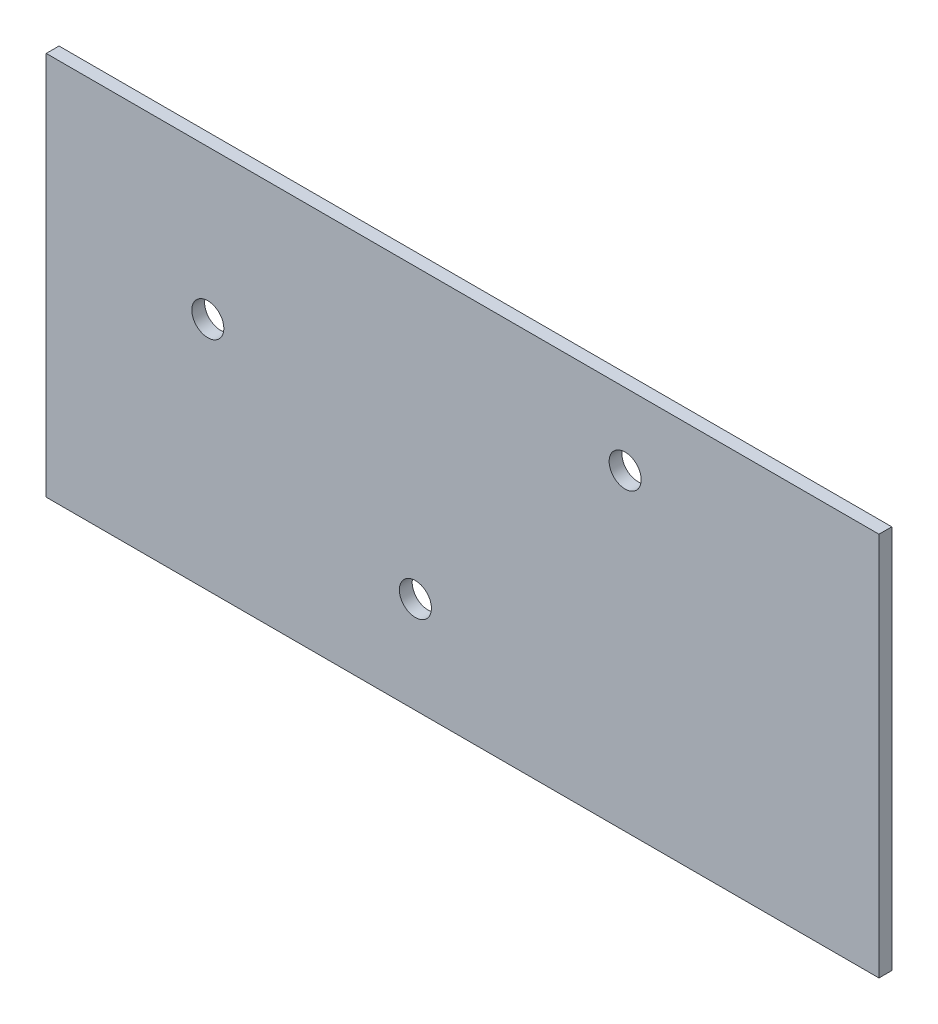
ISO-10303-21;
HEADER;
FILE_DESCRIPTION(('STEP AP214'),'2;1');
FILE_NAME('part.step','',(''),(''),'','','');
FILE_SCHEMA(('AUTOMOTIVE_DESIGN { 1 0 10303 214 1 1 1 1 }'));
ENDSEC;
DATA;
#1=APPLICATION_CONTEXT('core data for automotive mechanical design processes');
#2=APPLICATION_PROTOCOL_DEFINITION('international standard','automotive_design',2000,#1);
#3=PRODUCT_CONTEXT('',#1,'mechanical');
#4=PRODUCT('Part','Part','',(#3));
#5=PRODUCT_RELATED_PRODUCT_CATEGORY('part','',(#4));
#6=PRODUCT_DEFINITION_FORMATION('','',#4);
#7=PRODUCT_DEFINITION_CONTEXT('part definition',#1,'design');
#8=PRODUCT_DEFINITION('design','',#6,#7);
#9=PRODUCT_DEFINITION_SHAPE('','',#8);
#10=(LENGTH_UNIT() NAMED_UNIT(*) SI_UNIT(.MILLI.,.METRE.));
#11=(NAMED_UNIT(*) PLANE_ANGLE_UNIT() SI_UNIT($,.RADIAN.));
#12=(NAMED_UNIT(*) SI_UNIT($,.STERADIAN.) SOLID_ANGLE_UNIT());
#13=UNCERTAINTY_MEASURE_WITH_UNIT(LENGTH_MEASURE(1.E-05),#10,'distance_accuracy_value','');
#14=(GEOMETRIC_REPRESENTATION_CONTEXT(3) GLOBAL_UNCERTAINTY_ASSIGNED_CONTEXT((#13)) GLOBAL_UNIT_ASSIGNED_CONTEXT((#10,
#11,#12)) REPRESENTATION_CONTEXT('',''));
#15=CARTESIAN_POINT('',(0.,0.,0.));
#16=DIRECTION('',(0.,0.,1.));
#17=DIRECTION('',(1.,0.,0.));
#18=AXIS2_PLACEMENT_3D('',#15,#16,#17);
#19=CARTESIAN_POINT('',(-82.55,-38.1,2.54));
#20=DIRECTION('',(1.,0.,0.));
#21=DIRECTION('',(0.,0.,-1.));
#22=AXIS2_PLACEMENT_3D('',#19,#20,#21);
#23=PLANE('',#22);
#24=DIRECTION('',(0.,-1.,0.));
#25=VECTOR('',#24,1.);
#26=CARTESIAN_POINT('',(-82.55,-38.1,0.));
#27=LINE('',#26,#25);
#28=CARTESIAN_POINT('',(-82.55,38.1,0.));
#29=VERTEX_POINT('',#28);
#30=CARTESIAN_POINT('',(-82.55,-38.1,0.));
#31=VERTEX_POINT('',#30);
#32=EDGE_CURVE('E107',#29,#31,#27,.T.);
#33=ORIENTED_EDGE('',*,*,#32,.T.);
#34=DIRECTION('',(0.,0.,-1.));
#35=VECTOR('',#34,1.);
#36=CARTESIAN_POINT('',(-82.55,-38.1,2.54));
#37=LINE('',#36,#35);
#38=CARTESIAN_POINT('',(-82.55,-38.1,2.54));
#39=VERTEX_POINT('',#38);
#40=EDGE_CURVE('E11',#39,#31,#37,.T.);
#41=ORIENTED_EDGE('',*,*,#40,.F.);
#42=DIRECTION('',(0.,-1.,0.));
#43=VECTOR('',#42,1.);
#44=CARTESIAN_POINT('',(-82.55,-38.1,2.54));
#45=LINE('',#44,#43);
#46=CARTESIAN_POINT('',(-82.55,38.1,2.54));
#47=VERTEX_POINT('',#46);
#48=EDGE_CURVE('E91',#47,#39,#45,.T.);
#49=ORIENTED_EDGE('',*,*,#48,.F.);
#50=DIRECTION('',(0.,0.,-1.));
#51=VECTOR('',#50,1.);
#52=CARTESIAN_POINT('',(-82.55,38.1,2.54));
#53=LINE('',#52,#51);
#54=EDGE_CURVE('E103',#47,#29,#53,.T.);
#55=ORIENTED_EDGE('',*,*,#54,.T.);
#56=EDGE_LOOP('',(#33,#41,#49,#55));
#57=FACE_BOUND('',#56,.T.);
#58=ADVANCED_FACE('F39',(#57),#23,.F.);
#59=CARTESIAN_POINT('',(-82.55,-38.1,2.54));
#60=DIRECTION('',(0.,1.,0.));
#61=DIRECTION('',(0.,0.,1.));
#62=AXIS2_PLACEMENT_3D('',#59,#60,#61);
#63=PLANE('',#62);
#64=DIRECTION('',(1.,0.,0.));
#65=VECTOR('',#64,1.);
#66=CARTESIAN_POINT('',(-82.55,-38.1,0.));
#67=LINE('',#66,#65);
#68=CARTESIAN_POINT('',(82.55,-38.1,0.));
#69=VERTEX_POINT('',#68);
#70=EDGE_CURVE('E96',#31,#69,#67,.T.);
#71=ORIENTED_EDGE('',*,*,#70,.T.);
#72=DIRECTION('',(0.,0.,-1.));
#73=VECTOR('',#72,1.);
#74=CARTESIAN_POINT('',(82.55,-38.1,2.54));
#75=LINE('',#74,#73);
#76=CARTESIAN_POINT('',(82.55,-38.1,2.54));
#77=VERTEX_POINT('',#76);
#78=EDGE_CURVE('E48',#77,#69,#75,.T.);
#79=ORIENTED_EDGE('',*,*,#78,.F.);
#80=DIRECTION('',(1.,0.,0.));
#81=VECTOR('',#80,1.);
#82=CARTESIAN_POINT('',(-82.55,-38.1,2.54));
#83=LINE('',#82,#81);
#84=EDGE_CURVE('E86',#39,#77,#83,.T.);
#85=ORIENTED_EDGE('',*,*,#84,.F.);
#86=ORIENTED_EDGE('',*,*,#40,.T.);
#87=EDGE_LOOP('',(#71,#79,#85,#86));
#88=FACE_BOUND('',#87,.T.);
#89=ADVANCED_FACE('F95',(#88),#63,.F.);
#90=CARTESIAN_POINT('',(82.55,-38.1,2.54));
#91=DIRECTION('',(-1.,0.,0.));
#92=DIRECTION('',(0.,0.,1.));
#93=AXIS2_PLACEMENT_3D('',#90,#91,#92);
#94=PLANE('',#93);
#95=DIRECTION('',(0.,1.,0.));
#96=VECTOR('',#95,1.);
#97=CARTESIAN_POINT('',(82.55,-38.1,0.));
#98=LINE('',#97,#96);
#99=CARTESIAN_POINT('',(82.55,38.1,0.));
#100=VERTEX_POINT('',#99);
#101=EDGE_CURVE('E73',#69,#100,#98,.T.);
#102=ORIENTED_EDGE('',*,*,#101,.T.);
#103=DIRECTION('',(0.,0.,-1.));
#104=VECTOR('',#103,1.);
#105=CARTESIAN_POINT('',(82.55,38.1,2.54));
#106=LINE('',#105,#104);
#107=CARTESIAN_POINT('',(82.55,38.1,2.54));
#108=VERTEX_POINT('',#107);
#109=EDGE_CURVE('E98',#108,#100,#106,.T.);
#110=ORIENTED_EDGE('',*,*,#109,.F.);
#111=DIRECTION('',(0.,1.,0.));
#112=VECTOR('',#111,1.);
#113=CARTESIAN_POINT('',(82.55,-38.1,2.54));
#114=LINE('',#113,#112);
#115=EDGE_CURVE('E89',#77,#108,#114,.T.);
#116=ORIENTED_EDGE('',*,*,#115,.F.);
#117=ORIENTED_EDGE('',*,*,#78,.T.);
#118=EDGE_LOOP('',(#102,#110,#116,#117));
#119=FACE_BOUND('',#118,.T.);
#120=ADVANCED_FACE('F99',(#119),#94,.F.);
#121=CARTESIAN_POINT('',(-82.55,38.1,2.54));
#122=DIRECTION('',(0.,-1.,0.));
#123=DIRECTION('',(1.,0.,0.));
#124=AXIS2_PLACEMENT_3D('',#121,#122,#123);
#125=PLANE('',#124);
#126=DIRECTION('',(-1.,0.,0.));
#127=VECTOR('',#126,1.);
#128=CARTESIAN_POINT('',(-82.55,38.1,0.));
#129=LINE('',#128,#127);
#130=EDGE_CURVE('E79',#100,#29,#129,.T.);
#131=ORIENTED_EDGE('',*,*,#130,.T.);
#132=ORIENTED_EDGE('',*,*,#54,.F.);
#133=DIRECTION('',(-1.,0.,0.));
#134=VECTOR('',#133,1.);
#135=CARTESIAN_POINT('',(-82.55,38.1,2.54));
#136=LINE('',#135,#134);
#137=EDGE_CURVE('E56',#108,#47,#136,.T.);
#138=ORIENTED_EDGE('',*,*,#137,.F.);
#139=ORIENTED_EDGE('',*,*,#109,.T.);
#140=EDGE_LOOP('',(#131,#132,#138,#139));
#141=FACE_BOUND('',#140,.T.);
#142=ADVANCED_FACE('F121',(#141),#125,.F.);
#143=CARTESIAN_POINT('',(0.,0.,2.54));
#144=DIRECTION('',(0.,0.,-1.));
#145=DIRECTION('',(-1.,0.,0.));
#146=AXIS2_PLACEMENT_3D('',#143,#144,#145);
#147=PLANE('',#146);
#148=CARTESIAN_POINT('',(-50.5126452377917,8.47478773323949,2.54));
#149=DIRECTION('',(0.,0.,1.));
#150=DIRECTION('',(1.,0.,0.));
#151=AXIS2_PLACEMENT_3D('',#148,#149,#150);
#152=CIRCLE('',#151,3.175);
#153=CARTESIAN_POINT('',(-47.3376452377917,8.47478773323949,2.54));
#154=VERTEX_POINT('',#153);
#155=EDGE_CURVE('E147',#154,#154,#152,.T.);
#156=ORIENTED_EDGE('',*,*,#155,.F.);
#157=EDGE_LOOP('',(#156));
#158=FACE_BOUND('',#157,.T.);
#159=CARTESIAN_POINT('',(-9.35772738608875,-18.9892995308867,2.54));
#160=DIRECTION('',(0.,0.,1.));
#161=DIRECTION('',(1.,0.,0.));
#162=AXIS2_PLACEMENT_3D('',#159,#160,#161);
#163=CIRCLE('',#162,3.175);
#164=CARTESIAN_POINT('',(-6.18272738608876,-18.9892995308867,2.54));
#165=VERTEX_POINT('',#164);
#166=EDGE_CURVE('E139',#165,#165,#163,.T.);
#167=ORIENTED_EDGE('',*,*,#166,.F.);
#168=EDGE_LOOP('',(#167));
#169=FACE_BOUND('',#168,.T.);
#170=CARTESIAN_POINT('',(32.2272605261585,23.8610569553127,2.54));
#171=DIRECTION('',(0.,0.,1.));
#172=DIRECTION('',(1.,0.,0.));
#173=AXIS2_PLACEMENT_3D('',#170,#171,#172);
#174=CIRCLE('',#173,3.175);
#175=CARTESIAN_POINT('',(35.4022605261585,23.8610569553127,2.54));
#176=VERTEX_POINT('',#175);
#177=EDGE_CURVE('E131',#176,#176,#174,.T.);
#178=ORIENTED_EDGE('',*,*,#177,.F.);
#179=EDGE_LOOP('',(#178));
#180=FACE_BOUND('',#179,.T.);
#181=ORIENTED_EDGE('',*,*,#48,.T.);
#182=ORIENTED_EDGE('',*,*,#84,.T.);
#183=ORIENTED_EDGE('',*,*,#115,.T.);
#184=ORIENTED_EDGE('',*,*,#137,.T.);
#185=EDGE_LOOP('',(#181,#182,#183,#184));
#186=FACE_BOUND('',#185,.T.);
#187=ADVANCED_FACE('F87',(#158,#169,#180,#186),#147,.F.);
#188=CARTESIAN_POINT('',(0.,0.,0.));
#189=DIRECTION('',(0.,0.,-1.));
#190=DIRECTION('',(-1.,0.,0.));
#191=AXIS2_PLACEMENT_3D('',#188,#189,#190);
#192=PLANE('',#191);
#193=CARTESIAN_POINT('',(-50.5126452377917,8.47478773323949,0.));
#194=DIRECTION('',(0.,0.,1.));
#195=DIRECTION('',(1.,0.,0.));
#196=AXIS2_PLACEMENT_3D('',#193,#194,#195);
#197=CIRCLE('',#196,3.175);
#198=CARTESIAN_POINT('',(-47.3376452377917,8.47478773323949,0.));
#199=VERTEX_POINT('',#198);
#200=EDGE_CURVE('E143',#199,#199,#197,.T.);
#201=ORIENTED_EDGE('',*,*,#200,.T.);
#202=EDGE_LOOP('',(#201));
#203=FACE_BOUND('',#202,.T.);
#204=CARTESIAN_POINT('',(-9.35772738608875,-18.9892995308867,0.));
#205=DIRECTION('',(0.,0.,1.));
#206=DIRECTION('',(1.,0.,0.));
#207=AXIS2_PLACEMENT_3D('',#204,#205,#206);
#208=CIRCLE('',#207,3.175);
#209=CARTESIAN_POINT('',(-6.18272738608876,-18.9892995308867,0.));
#210=VERTEX_POINT('',#209);
#211=EDGE_CURVE('E135',#210,#210,#208,.T.);
#212=ORIENTED_EDGE('',*,*,#211,.T.);
#213=EDGE_LOOP('',(#212));
#214=FACE_BOUND('',#213,.T.);
#215=CARTESIAN_POINT('',(32.2272605261585,23.8610569553127,0.));
#216=DIRECTION('',(0.,0.,1.));
#217=DIRECTION('',(1.,0.,0.));
#218=AXIS2_PLACEMENT_3D('',#215,#216,#217);
#219=CIRCLE('',#218,3.175);
#220=CARTESIAN_POINT('',(35.4022605261585,23.8610569553127,0.));
#221=VERTEX_POINT('',#220);
#222=EDGE_CURVE('E111',#221,#221,#219,.T.);
#223=ORIENTED_EDGE('',*,*,#222,.T.);
#224=EDGE_LOOP('',(#223));
#225=FACE_BOUND('',#224,.T.);
#226=ORIENTED_EDGE('',*,*,#32,.F.);
#227=ORIENTED_EDGE('',*,*,#130,.F.);
#228=ORIENTED_EDGE('',*,*,#101,.F.);
#229=ORIENTED_EDGE('',*,*,#70,.F.);
#230=EDGE_LOOP('',(#226,#227,#228,#229));
#231=FACE_BOUND('',#230,.T.);
#232=ADVANCED_FACE('F124',(#203,#214,#225,#231),#192,.T.);
#233=CARTESIAN_POINT('',(32.2272605261585,23.8610569553127,2.54));
#234=DIRECTION('',(0.,0.,1.));
#235=DIRECTION('',(1.,0.,0.));
#236=AXIS2_PLACEMENT_3D('',#233,#234,#235);
#237=CYLINDRICAL_SURFACE('',#236,3.175);
#238=ORIENTED_EDGE('',*,*,#222,.F.);
#239=EDGE_LOOP('',(#238));
#240=FACE_BOUND('',#239,.T.);
#241=ORIENTED_EDGE('',*,*,#177,.T.);
#242=EDGE_LOOP('',(#241));
#243=FACE_BOUND('',#242,.T.);
#244=ADVANCED_FACE('F161',(#240,#243),#237,.F.);
#245=CARTESIAN_POINT('',(-9.35772738608875,-18.9892995308867,2.54));
#246=DIRECTION('',(0.,0.,1.));
#247=DIRECTION('',(1.,0.,0.));
#248=AXIS2_PLACEMENT_3D('',#245,#246,#247);
#249=CYLINDRICAL_SURFACE('',#248,3.175);
#250=ORIENTED_EDGE('',*,*,#211,.F.);
#251=EDGE_LOOP('',(#250));
#252=FACE_BOUND('',#251,.T.);
#253=ORIENTED_EDGE('',*,*,#166,.T.);
#254=EDGE_LOOP('',(#253));
#255=FACE_BOUND('',#254,.T.);
#256=ADVANCED_FACE('F163',(#252,#255),#249,.F.);
#257=CARTESIAN_POINT('',(-50.5126452377917,8.47478773323949,2.54));
#258=DIRECTION('',(0.,0.,1.));
#259=DIRECTION('',(1.,0.,0.));
#260=AXIS2_PLACEMENT_3D('',#257,#258,#259);
#261=CYLINDRICAL_SURFACE('',#260,3.175);
#262=ORIENTED_EDGE('',*,*,#200,.F.);
#263=EDGE_LOOP('',(#262));
#264=FACE_BOUND('',#263,.T.);
#265=ORIENTED_EDGE('',*,*,#155,.T.);
#266=EDGE_LOOP('',(#265));
#267=FACE_BOUND('',#266,.T.);
#268=ADVANCED_FACE('F152',(#264,#267),#261,.F.);
#269=CLOSED_SHELL('',(#58,#89,#120,#142,#187,#232,#244,#256,#268));
#270=MANIFOLD_SOLID_BREP('B2',#269);
#271=ADVANCED_BREP_SHAPE_REPRESENTATION('',(#18,#270),#14);
#272=SHAPE_DEFINITION_REPRESENTATION(#9,#271);
ENDSEC;
END-ISO-10303-21;
